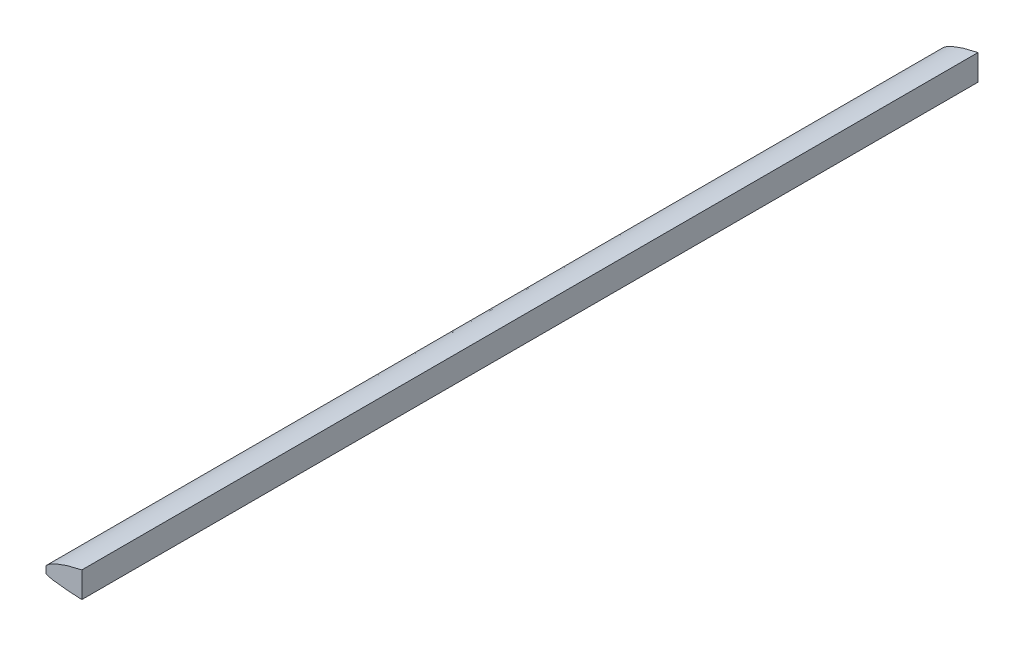
ISO-10303-21;
HEADER;
FILE_DESCRIPTION(('STEP AP214'),'2;1');
FILE_NAME('part.step','',(''),(''),'','','');
FILE_SCHEMA(('AUTOMOTIVE_DESIGN { 1 0 10303 214 1 1 1 1 }'));
ENDSEC;
DATA;
#1=APPLICATION_CONTEXT('core data for automotive mechanical design processes');
#2=APPLICATION_PROTOCOL_DEFINITION('international standard','automotive_design',2000,#1);
#3=PRODUCT_CONTEXT('',#1,'mechanical');
#4=PRODUCT('Part','Part','',(#3));
#5=PRODUCT_RELATED_PRODUCT_CATEGORY('part','',(#4));
#6=PRODUCT_DEFINITION_FORMATION('','',#4);
#7=PRODUCT_DEFINITION_CONTEXT('part definition',#1,'design');
#8=PRODUCT_DEFINITION('design','',#6,#7);
#9=PRODUCT_DEFINITION_SHAPE('','',#8);
#10=(LENGTH_UNIT() NAMED_UNIT(*) SI_UNIT(.MILLI.,.METRE.));
#11=(NAMED_UNIT(*) PLANE_ANGLE_UNIT() SI_UNIT($,.RADIAN.));
#12=(NAMED_UNIT(*) SI_UNIT($,.STERADIAN.) SOLID_ANGLE_UNIT());
#13=UNCERTAINTY_MEASURE_WITH_UNIT(LENGTH_MEASURE(1.E-05),#10,'distance_accuracy_value','');
#14=(GEOMETRIC_REPRESENTATION_CONTEXT(3) GLOBAL_UNCERTAINTY_ASSIGNED_CONTEXT((#13)) GLOBAL_UNIT_ASSIGNED_CONTEXT((#10,
#11,#12)) REPRESENTATION_CONTEXT('',''));
#15=CARTESIAN_POINT('',(0.,0.,0.));
#16=DIRECTION('',(0.,0.,1.));
#17=DIRECTION('',(1.,0.,0.));
#18=AXIS2_PLACEMENT_3D('',#15,#16,#17);
#19=CARTESIAN_POINT('',(0.,0.,146.05));
#20=DIRECTION('',(0.,0.,-1.));
#21=DIRECTION('',(-1.,0.,0.));
#22=AXIS2_PLACEMENT_3D('',#19,#20,#21);
#23=PLANE('',#22);
#24=DIRECTION('',(0.866025403784439,0.5,0.));
#25=VECTOR('',#24,1.);
#26=CARTESIAN_POINT('',(2.3303693429844,5.47680789310905,146.05));
#27=LINE('',#26,#25);
#28=CARTESIAN_POINT('',(2.3303693429844,5.47680789310905,146.05));
#29=VERTEX_POINT('',#28);
#30=CARTESIAN_POINT('',(5.07999999999999,7.06430789310905,146.05));
#31=VERTEX_POINT('',#30);
#32=EDGE_CURVE('E62',#29,#31,#27,.T.);
#33=ORIENTED_EDGE('',*,*,#32,.F.);
#34=DIRECTION('',(-0.866025403784439,0.5,0.));
#35=VECTOR('',#34,1.);
#36=CARTESIAN_POINT('',(5.08,3.88930789310905,146.05));
#37=LINE('',#36,#35);
#38=CARTESIAN_POINT('',(5.08,3.88930789310905,146.05));
#39=VERTEX_POINT('',#38);
#40=EDGE_CURVE('E124',#39,#29,#37,.T.);
#41=ORIENTED_EDGE('',*,*,#40,.F.);
#42=DIRECTION('',(0.,-1.,0.));
#43=VECTOR('',#42,1.);
#44=CARTESIAN_POINT('',(5.07999999999999,7.06430789310905,146.05));
#45=LINE('',#44,#43);
#46=EDGE_CURVE('E128',#31,#39,#45,.T.);
#47=ORIENTED_EDGE('',*,*,#46,.F.);
#48=EDGE_LOOP('',(#33,#41,#47));
#49=FACE_BOUND('',#48,.T.);
#50=CARTESIAN_POINT('',(153.012432907803,4.29837249355147,146.05));
#51=CARTESIAN_POINT('',(153.022573334159,4.30118431269829,146.05));
#52=CARTESIAN_POINT('',(152.678508981355,4.39868366144014,146.05));
#53=CARTESIAN_POINT('',(152.295031799488,4.45819845736958,146.05));
#54=CARTESIAN_POINT('',(151.419651144968,4.63623546443887,146.05));
#55=CARTESIAN_POINT('',(150.306621227649,4.81994518645088,146.05));
#56=CARTESIAN_POINT('',(148.842264128699,5.05275069448044,146.05));
#57=CARTESIAN_POINT('',(147.079406650399,5.30519000583204,146.05));
#58=CARTESIAN_POINT('',(145.005570500231,5.57759143301607,146.05));
#59=CARTESIAN_POINT('',(142.640765029642,5.86996469793655,146.05));
#60=CARTESIAN_POINT('',(139.989682455775,6.17922853478585,146.05));
#61=CARTESIAN_POINT('',(137.070106626542,6.51243791860869,146.05));
#62=CARTESIAN_POINT('',(133.884240493452,6.85688845391339,146.05));
#63=CARTESIAN_POINT('',(130.460581802081,7.23137195215701,146.05));
#64=CARTESIAN_POINT('',(126.794849786887,7.60644249223347,146.05));
#65=CARTESIAN_POINT('',(122.924160628096,8.00850621957419,146.05));
#66=CARTESIAN_POINT('',(118.840208590138,8.40089331029352,146.05));
#67=CARTESIAN_POINT('',(114.590309308745,8.82458088035817,146.05));
#68=CARTESIAN_POINT('',(110.158128176204,9.22165070858286,146.05));
#69=CARTESIAN_POINT('',(105.602476123186,9.64686823191567,146.05));
#70=CARTESIAN_POINT('',(100.897750103666,10.0165723520943,146.05));
#71=CARTESIAN_POINT('',(96.1098862738167,10.4049193208244,146.05));
#72=CARTESIAN_POINT('',(91.2149860561175,10.7205257289516,146.05));
#73=CARTESIAN_POINT('',(86.2751511916193,11.0442067251602,146.05));
#74=CARTESIAN_POINT('',(81.2734260591433,11.2779199326131,146.05));
#75=CARTESIAN_POINT('',(76.267137495775,11.5209089314635,146.05));
#76=CARTESIAN_POINT('',(71.2469211080151,11.6654306063464,146.05));
#77=CARTESIAN_POINT('',(66.258398862737,11.8205461864606,146.05));
#78=CARTESIAN_POINT('',(61.3048316502527,11.8630014345476,146.05));
#79=CARTESIAN_POINT('',(56.419109221408,11.9259648616699,146.05));
#80=CARTESIAN_POINT('',(51.6194124542509,11.8696352348893,146.05));
#81=CARTESIAN_POINT('',(46.9181564412518,11.8388145387859,146.05));
#82=CARTESIAN_POINT('',(42.355323514573,11.675352411223,146.05));
#83=CARTESIAN_POINT('',(37.9157653846814,11.5452903510272,146.05));
#84=CARTESIAN_POINT('',(33.6718477935265,11.2744230673563,146.05));
#85=CARTESIAN_POINT('',(29.5689843969307,11.0558893000296,146.05));
#86=CARTESIAN_POINT('',(25.7178012372257,10.6982868697439,146.05));
#87=CARTESIAN_POINT('',(22.0176822934619,10.4045123397973,146.05));
#88=CARTESIAN_POINT('',(18.6277024859319,9.97033824630898,146.05));
#89=CARTESIAN_POINT('',(15.3900972351653,9.61265907303944,146.05));
#90=CARTESIAN_POINT('',(12.5258162960307,9.11771225423672,146.05));
#91=CARTESIAN_POINT('',(9.79767436313593,8.71535866885037,146.05));
#92=CARTESIAN_POINT('',(7.50495718541674,8.1832668916392,146.05));
#93=CARTESIAN_POINT('',(5.39222181023161,7.73374483486204,146.05));
#94=CARTESIAN_POINT('',(3.57070788587368,7.26907779018686,146.05));
#95=CARTESIAN_POINT('',(2.12655851510634,6.74077448073247,146.05));
#96=CARTESIAN_POINT('',(0.914157710362412,6.19460042832124,146.05));
#97=CARTESIAN_POINT('',(0.15767537080493,5.6063909258422,146.05));
#98=CARTESIAN_POINT('',(-0.35698682188203,5.05550558679625,146.05));
#99=CARTESIAN_POINT('',(-0.678341927550519,4.61422846933056,146.05));
#100=CARTESIAN_POINT('',(-0.319052451785432,4.30324516681086,146.05));
#101=CARTESIAN_POINT('',(0.234859356501809,4.11539486330063,146.05));
#102=CARTESIAN_POINT('',(0.954407327379445,3.83068254754896,146.05));
#103=CARTESIAN_POINT('',(2.21877066694904,3.71764725258398,146.05));
#104=CARTESIAN_POINT('',(3.62457814535737,3.50273487916637,146.05));
#105=CARTESIAN_POINT('',(5.43785481775306,3.45031916594526,146.05));
#106=CARTESIAN_POINT('',(7.48693529718263,3.29497199585972,146.05));
#107=CARTESIAN_POINT('',(9.86816687280448,3.26475787543062,146.05));
#108=CARTESIAN_POINT('',(12.5081941404158,3.1509548472924,146.05));
#109=CARTESIAN_POINT('',(15.4362318824158,3.14185418539038,146.05));
#110=CARTESIAN_POINT('',(18.6151281650926,3.06467205968896,146.05));
#111=CARTESIAN_POINT('',(22.0463271189,3.08163266799285,146.05));
#112=CARTESIAN_POINT('',(25.7076515695333,3.04511260097475,146.05));
#113=CARTESIAN_POINT('',(29.5839092345066,3.09764845206463,146.05));
#114=CARTESIAN_POINT('',(33.6635362797634,3.10884545570665,146.05));
#115=CARTESIAN_POINT('',(37.920949513916,3.19981311775283,146.05));
#116=CARTESIAN_POINT('',(42.3490659476905,3.26290559648343,146.05));
#117=CARTESIAN_POINT('',(46.9146521732959,3.39923176622328,146.05));
#118=CARTESIAN_POINT('',(51.6136830932782,3.52012224006816,146.05));
#119=CARTESIAN_POINT('',(56.4099068791947,3.70493235913291,146.05));
#120=CARTESIAN_POINT('',(61.2981098510059,3.88761250696498,146.05));
#121=CARTESIAN_POINT('',(66.2450330473595,4.10924302409385,146.05));
#122=CARTESIAN_POINT('',(71.2391283330745,4.33403593791469,146.05));
#123=CARTESIAN_POINT('',(76.2494162289338,4.58425167157895,146.05));
#124=CARTESIAN_POINT('',(81.2624186759353,4.82798436590932,146.05));
#125=CARTESIAN_POINT('',(86.2526690324931,5.06862202845023,146.05));
#126=CARTESIAN_POINT('',(91.2039120683193,5.2809167159101,146.05));
#127=CARTESIAN_POINT('',(96.0865267873852,5.4887710665121,146.05));
#128=CARTESIAN_POINT('',(100.888840607821,5.65212866211545,146.05));
#129=CARTESIAN_POINT('',(105.581626282774,5.80420430333908,146.05));
#130=CARTESIAN_POINT('',(110.15254220831,5.90750661208399,146.05));
#131=CARTESIAN_POINT('',(114.576522504296,5.99101793059228,146.05));
#132=CARTESIAN_POINT('',(118.837497009477,6.03098892842079,146.05));
#133=CARTESIAN_POINT('',(122.915455049581,6.04285957328049,146.05));
#134=CARTESIAN_POINT('',(126.793680698212,6.01421549350386,146.05));
#135=CARTESIAN_POINT('',(130.455970759297,5.95060191346392,146.05));
#136=CARTESIAN_POINT('',(133.885862747905,5.85271808704428,146.05));
#137=CARTESIAN_POINT('',(137.069006345872,5.73047195884317,146.05));
#138=CARTESIAN_POINT('',(139.990790992459,5.58429748650498,146.05));
#139=CARTESIAN_POINT('',(142.640947983578,5.42420701731081,146.05));
#140=CARTESIAN_POINT('',(145.006736539072,5.25114523637785,146.05));
#141=CARTESIAN_POINT('',(147.078556667493,5.06763854279981,146.05));
#142=CARTESIAN_POINT('',(148.843562392255,4.88617709647787,146.05));
#143=CARTESIAN_POINT('',(150.306318308517,4.7029505630139,146.05));
#144=CARTESIAN_POINT('',(151.416283885139,4.55087689583804,146.05));
#145=CARTESIAN_POINT('',(152.292722615316,4.41207523136557,146.05));
#146=CARTESIAN_POINT('',(152.669747914108,4.35480990770027,146.05));
#147=CARTESIAN_POINT('',(153.003840170839,4.29598983019275,146.05));
#148=CARTESIAN_POINT('',(153.012432907803,4.29837249355147,146.05));
#149=B_SPLINE_CURVE_WITH_KNOTS('',3,(#50,#51,#52,#53,#54,#55,#56,#57,#58,#59,#60,#61,#62,#63,
#64,#65,#66,#67,#68,#69,#70,#71,#72,#73,#74,#75,#76,#77,#78,#79,#80,#81,#82,#83,#84,#85,#86,#87,
#88,#89,#90,#91,#92,#93,#94,#95,#96,#97,#98,#99,#100,#101,#102,#103,#104,#105,#106,#107,#108,
#109,#110,#111,#112,#113,#114,#115,#116,#117,#118,#119,#120,#121,#122,#123,#124,#125,#126,#127,
#128,#129,#130,#131,#132,#133,#134,#135,#136,#137,#138,#139,#140,#141,#142,#143,#144,#145,#146,
#147,#148),.UNSPECIFIED.,.T.,.F.,(4,1,1,1,1,1,1,1,1,1,1,1,1,1,1,1,1,1,1,1,1,1,1,1,1,1,1,1,1,1,1,
1,1,1,1,1,1,1,1,1,1,1,1,1,1,1,1,1,1,1,1,1,1,1,1,1,1,1,1,1,1,1,1,1,1,1,1,1,1,1,1,1,1,1,1,1,1,1,1,
1,1,1,1,1,1,1,1,1,1,1,1,1,1,1,1,1,4),(0.,0.000652375800474001,0.00240344824305293,
0.00525656825777616,0.00916576414525399,0.0140967507887129,0.0200220121070894,
0.0268963436763612,0.0347063828713069,0.0434144575923079,0.0529900197240517,0.0633968094728075,
0.0746012542197577,0.0865310302989372,0.099154299734113,0.112392946202992,0.126224491561968,
0.140544888717164,0.155318673337255,0.170431652347923,0.185859272314617,0.201486855100767,
0.21729337680491,0.233167489320596,0.249086100090761,0.264958726174628,0.280747986632832,
0.296380919150158,0.311801213814499,0.326956198280747,0.34178274714053,0.356247564285208,
0.370274835051458,0.383861908178782,0.396887692238994,0.409401211668324,0.421252505987224,
0.432540778472774,0.44306525269204,0.452987148289923,0.462044499089512,0.470525623352609,
0.478015713742355,0.484719935647003,0.490901449374763,0.496493482376747,0.501934630302492,
0.506331603851298,0.510717666514293,0.511954044649899,0.514195842006017,0.517506907461632,
0.521314719070869,0.526107089755545,0.531740962786565,0.538337761174815,0.545822104103918,
0.554208083816506,0.563431264261174,0.573484426850772,0.584310043394845,0.595866543172384,
0.608108296907278,0.620979221659939,0.634441733895477,0.648424207084819,0.662880137047378,
0.677739163464503,0.692957281121996,0.708452452705004,0.724176515371476,0.740041983978664,
0.755990469053507,0.771938352799948,0.787811293886201,0.803535896442132,0.819040498411977,
0.834255057735326,0.849121194519524,0.863570137224621,0.877552378440428,0.891006015922545,
0.903874254768139,0.916114355519662,0.927680383940068,0.938530909249465,0.948621564264013,
0.957908586509766,0.96636362872513,0.97395265018994,0.980639894713798,0.986402982837544,
0.991206560358905,0.995011197109476,0.997773025834374,0.999447193494769,1.),.UNSPECIFIED.);
#150=CARTESIAN_POINT('',(0.,5.42630262358505,146.05));
#151=VERTEX_POINT('',#150);
#152=CARTESIAN_POINT('',(6.35,7.93630563927071,146.05));
#153=VERTEX_POINT('',#152);
#154=EDGE_CURVE('E192',#151,#153,#149,.F.);
#155=ORIENTED_EDGE('',*,*,#154,.T.);
#156=DIRECTION('',(0.,-1.,0.));
#157=VECTOR('',#156,1.);
#158=CARTESIAN_POINT('',(6.35,0.,146.05));
#159=LINE('',#158,#157);
#160=CARTESIAN_POINT('',(6.35,3.38130789310905,146.05));
#161=VERTEX_POINT('',#160);
#162=EDGE_CURVE('E183',#153,#161,#159,.T.);
#163=ORIENTED_EDGE('',*,*,#162,.T.);
#164=CARTESIAN_POINT('',(153.012432907803,4.29837249355147,146.05));
#165=CARTESIAN_POINT('',(153.022573334159,4.30118431269829,146.05));
#166=CARTESIAN_POINT('',(152.678508981355,4.39868366144014,146.05));
#167=CARTESIAN_POINT('',(152.295031799488,4.45819845736958,146.05));
#168=CARTESIAN_POINT('',(151.419651144968,4.63623546443887,146.05));
#169=CARTESIAN_POINT('',(150.306621227649,4.81994518645088,146.05));
#170=CARTESIAN_POINT('',(148.842264128699,5.05275069448044,146.05));
#171=CARTESIAN_POINT('',(147.079406650399,5.30519000583204,146.05));
#172=CARTESIAN_POINT('',(145.005570500231,5.57759143301607,146.05));
#173=CARTESIAN_POINT('',(142.640765029642,5.86996469793655,146.05));
#174=CARTESIAN_POINT('',(139.989682455775,6.17922853478585,146.05));
#175=CARTESIAN_POINT('',(137.070106626542,6.51243791860869,146.05));
#176=CARTESIAN_POINT('',(133.884240493452,6.85688845391339,146.05));
#177=CARTESIAN_POINT('',(130.460581802081,7.23137195215701,146.05));
#178=CARTESIAN_POINT('',(126.794849786887,7.60644249223347,146.05));
#179=CARTESIAN_POINT('',(122.924160628096,8.00850621957419,146.05));
#180=CARTESIAN_POINT('',(118.840208590138,8.40089331029352,146.05));
#181=CARTESIAN_POINT('',(114.590309308745,8.82458088035817,146.05));
#182=CARTESIAN_POINT('',(110.158128176204,9.22165070858286,146.05));
#183=CARTESIAN_POINT('',(105.602476123186,9.64686823191567,146.05));
#184=CARTESIAN_POINT('',(100.897750103666,10.0165723520943,146.05));
#185=CARTESIAN_POINT('',(96.1098862738167,10.4049193208244,146.05));
#186=CARTESIAN_POINT('',(91.2149860561175,10.7205257289516,146.05));
#187=CARTESIAN_POINT('',(86.2751511916193,11.0442067251602,146.05));
#188=CARTESIAN_POINT('',(81.2734260591433,11.2779199326131,146.05));
#189=CARTESIAN_POINT('',(76.267137495775,11.5209089314635,146.05));
#190=CARTESIAN_POINT('',(71.2469211080151,11.6654306063464,146.05));
#191=CARTESIAN_POINT('',(66.258398862737,11.8205461864606,146.05));
#192=CARTESIAN_POINT('',(61.3048316502527,11.8630014345476,146.05));
#193=CARTESIAN_POINT('',(56.419109221408,11.9259648616699,146.05));
#194=CARTESIAN_POINT('',(51.6194124542509,11.8696352348893,146.05));
#195=CARTESIAN_POINT('',(46.9181564412518,11.8388145387859,146.05));
#196=CARTESIAN_POINT('',(42.355323514573,11.675352411223,146.05));
#197=CARTESIAN_POINT('',(37.9157653846814,11.5452903510272,146.05));
#198=CARTESIAN_POINT('',(33.6718477935265,11.2744230673563,146.05));
#199=CARTESIAN_POINT('',(29.5689843969307,11.0558893000296,146.05));
#200=CARTESIAN_POINT('',(25.7178012372257,10.6982868697439,146.05));
#201=CARTESIAN_POINT('',(22.0176822934619,10.4045123397973,146.05));
#202=CARTESIAN_POINT('',(18.6277024859319,9.97033824630898,146.05));
#203=CARTESIAN_POINT('',(15.3900972351653,9.61265907303944,146.05));
#204=CARTESIAN_POINT('',(12.5258162960307,9.11771225423672,146.05));
#205=CARTESIAN_POINT('',(9.79767436313593,8.71535866885037,146.05));
#206=CARTESIAN_POINT('',(7.50495718541674,8.1832668916392,146.05));
#207=CARTESIAN_POINT('',(5.39222181023161,7.73374483486204,146.05));
#208=CARTESIAN_POINT('',(3.57070788587368,7.26907779018686,146.05));
#209=CARTESIAN_POINT('',(2.12655851510634,6.74077448073247,146.05));
#210=CARTESIAN_POINT('',(0.914157710362412,6.19460042832124,146.05));
#211=CARTESIAN_POINT('',(0.15767537080493,5.6063909258422,146.05));
#212=CARTESIAN_POINT('',(-0.35698682188203,5.05550558679625,146.05));
#213=CARTESIAN_POINT('',(-0.678341927550519,4.61422846933056,146.05));
#214=CARTESIAN_POINT('',(-0.319052451785432,4.30324516681086,146.05));
#215=CARTESIAN_POINT('',(0.234859356501809,4.11539486330063,146.05));
#216=CARTESIAN_POINT('',(0.954407327379445,3.83068254754896,146.05));
#217=CARTESIAN_POINT('',(2.21877066694904,3.71764725258398,146.05));
#218=CARTESIAN_POINT('',(3.62457814535737,3.50273487916637,146.05));
#219=CARTESIAN_POINT('',(5.43785481775306,3.45031916594526,146.05));
#220=CARTESIAN_POINT('',(7.48693529718263,3.29497199585972,146.05));
#221=CARTESIAN_POINT('',(9.86816687280448,3.26475787543062,146.05));
#222=CARTESIAN_POINT('',(12.5081941404158,3.1509548472924,146.05));
#223=CARTESIAN_POINT('',(15.4362318824158,3.14185418539038,146.05));
#224=CARTESIAN_POINT('',(18.6151281650926,3.06467205968896,146.05));
#225=CARTESIAN_POINT('',(22.0463271189,3.08163266799285,146.05));
#226=CARTESIAN_POINT('',(25.7076515695333,3.04511260097475,146.05));
#227=CARTESIAN_POINT('',(29.5839092345066,3.09764845206463,146.05));
#228=CARTESIAN_POINT('',(33.6635362797634,3.10884545570665,146.05));
#229=CARTESIAN_POINT('',(37.920949513916,3.19981311775283,146.05));
#230=CARTESIAN_POINT('',(42.3490659476905,3.26290559648343,146.05));
#231=CARTESIAN_POINT('',(46.9146521732959,3.39923176622328,146.05));
#232=CARTESIAN_POINT('',(51.6136830932782,3.52012224006816,146.05));
#233=CARTESIAN_POINT('',(56.4099068791947,3.70493235913291,146.05));
#234=CARTESIAN_POINT('',(61.2981098510059,3.88761250696498,146.05));
#235=CARTESIAN_POINT('',(66.2450330473595,4.10924302409385,146.05));
#236=CARTESIAN_POINT('',(71.2391283330745,4.33403593791469,146.05));
#237=CARTESIAN_POINT('',(76.2494162289338,4.58425167157895,146.05));
#238=CARTESIAN_POINT('',(81.2624186759353,4.82798436590932,146.05));
#239=CARTESIAN_POINT('',(86.2526690324931,5.06862202845023,146.05));
#240=CARTESIAN_POINT('',(91.2039120683193,5.2809167159101,146.05));
#241=CARTESIAN_POINT('',(96.0865267873852,5.4887710665121,146.05));
#242=CARTESIAN_POINT('',(100.888840607821,5.65212866211545,146.05));
#243=CARTESIAN_POINT('',(105.581626282774,5.80420430333908,146.05));
#244=CARTESIAN_POINT('',(110.15254220831,5.90750661208399,146.05));
#245=CARTESIAN_POINT('',(114.576522504296,5.99101793059228,146.05));
#246=CARTESIAN_POINT('',(118.837497009477,6.03098892842079,146.05));
#247=CARTESIAN_POINT('',(122.915455049581,6.04285957328049,146.05));
#248=CARTESIAN_POINT('',(126.793680698212,6.01421549350386,146.05));
#249=CARTESIAN_POINT('',(130.455970759297,5.95060191346392,146.05));
#250=CARTESIAN_POINT('',(133.885862747905,5.85271808704428,146.05));
#251=CARTESIAN_POINT('',(137.069006345872,5.73047195884317,146.05));
#252=CARTESIAN_POINT('',(139.990790992459,5.58429748650498,146.05));
#253=CARTESIAN_POINT('',(142.640947983578,5.42420701731081,146.05));
#254=CARTESIAN_POINT('',(145.006736539072,5.25114523637785,146.05));
#255=CARTESIAN_POINT('',(147.078556667493,5.06763854279981,146.05));
#256=CARTESIAN_POINT('',(148.843562392255,4.88617709647787,146.05));
#257=CARTESIAN_POINT('',(150.306318308517,4.7029505630139,146.05));
#258=CARTESIAN_POINT('',(151.416283885139,4.55087689583804,146.05));
#259=CARTESIAN_POINT('',(152.292722615316,4.41207523136557,146.05));
#260=CARTESIAN_POINT('',(152.669747914108,4.35480990770027,146.05));
#261=CARTESIAN_POINT('',(153.003840170839,4.29598983019275,146.05));
#262=CARTESIAN_POINT('',(153.012432907803,4.29837249355147,146.05));
#263=B_SPLINE_CURVE_WITH_KNOTS('',3,(#164,#165,#166,#167,#168,#169,#170,#171,#172,#173,#174,
#175,#176,#177,#178,#179,#180,#181,#182,#183,#184,#185,#186,#187,#188,#189,#190,#191,#192,#193,
#194,#195,#196,#197,#198,#199,#200,#201,#202,#203,#204,#205,#206,#207,#208,#209,#210,#211,#212,
#213,#214,#215,#216,#217,#218,#219,#220,#221,#222,#223,#224,#225,#226,#227,#228,#229,#230,#231,
#232,#233,#234,#235,#236,#237,#238,#239,#240,#241,#242,#243,#244,#245,#246,#247,#248,#249,#250,
#251,#252,#253,#254,#255,#256,#257,#258,#259,#260,#261,#262),.UNSPECIFIED.,.T.,.F.,(4,1,1,1,1,1,
1,1,1,1,1,1,1,1,1,1,1,1,1,1,1,1,1,1,1,1,1,1,1,1,1,1,1,1,1,1,1,1,1,1,1,1,1,1,1,1,1,1,1,1,1,1,1,1,
1,1,1,1,1,1,1,1,1,1,1,1,1,1,1,1,1,1,1,1,1,1,1,1,1,1,1,1,1,1,1,1,1,1,1,1,1,1,1,1,1,1,4),(0.,
0.000652375800474001,0.00240344824305293,0.00525656825777616,0.00916576414525399,
0.0140967507887129,0.0200220121070894,0.0268963436763612,0.0347063828713069,0.0434144575923079,
0.0529900197240517,0.0633968094728075,0.0746012542197577,0.0865310302989372,0.099154299734113,
0.112392946202992,0.126224491561968,0.140544888717164,0.155318673337255,0.170431652347923,
0.185859272314617,0.201486855100767,0.21729337680491,0.233167489320596,0.249086100090761,
0.264958726174628,0.280747986632832,0.296380919150158,0.311801213814499,0.326956198280747,
0.34178274714053,0.356247564285208,0.370274835051458,0.383861908178782,0.396887692238994,
0.409401211668324,0.421252505987224,0.432540778472774,0.44306525269204,0.452987148289923,
0.462044499089512,0.470525623352609,0.478015713742355,0.484719935647003,0.490901449374763,
0.496493482376747,0.501934630302492,0.506331603851298,0.510717666514293,0.511954044649899,
0.514195842006017,0.517506907461632,0.521314719070869,0.526107089755545,0.531740962786565,
0.538337761174815,0.545822104103918,0.554208083816506,0.563431264261174,0.573484426850772,
0.584310043394845,0.595866543172384,0.608108296907278,0.620979221659939,0.634441733895477,
0.648424207084819,0.662880137047378,0.677739163464503,0.692957281121996,0.708452452705004,
0.724176515371476,0.740041983978664,0.755990469053507,0.771938352799948,0.787811293886201,
0.803535896442132,0.819040498411977,0.834255057735326,0.849121194519524,0.863570137224621,
0.877552378440428,0.891006015922545,0.903874254768139,0.916114355519662,0.927680383940068,
0.938530909249465,0.948621564264013,0.957908586509766,0.96636362872513,0.97395265018994,
0.980639894713798,0.986402982837544,0.991206560358905,0.995011197109476,0.997773025834374,
0.999447193494769,1.),.UNSPECIFIED.);
#264=CARTESIAN_POINT('',(0.,4.19416671617205,146.05));
#265=VERTEX_POINT('',#264);
#266=EDGE_CURVE('E140',#161,#265,#263,.F.);
#267=ORIENTED_EDGE('',*,*,#266,.T.);
#268=DIRECTION('',(0.,-1.,0.));
#269=VECTOR('',#268,1.);
#270=CARTESIAN_POINT('',(0.,0.,146.05));
#271=LINE('',#270,#269);
#272=EDGE_CURVE('E153',#151,#265,#271,.T.);
#273=ORIENTED_EDGE('',*,*,#272,.F.);
#274=EDGE_LOOP('',(#155,#163,#267,#273));
#275=FACE_BOUND('',#274,.T.);
#276=ADVANCED_FACE('F44',(#49,#275),#23,.T.);
#277=CARTESIAN_POINT('',(6.35,0.,304.8));
#278=DIRECTION('',(-1.,0.,0.));
#279=DIRECTION('',(0.,0.,1.));
#280=AXIS2_PLACEMENT_3D('',#277,#278,#279);
#281=PLANE('',#280);
#282=ORIENTED_EDGE('',*,*,#162,.F.);
#283=DIRECTION('',(0.,0.,-1.));
#284=VECTOR('',#283,1.);
#285=CARTESIAN_POINT('',(6.35,7.93630563927071,304.8));
#286=LINE('',#285,#284);
#287=CARTESIAN_POINT('',(6.35,7.93630563927071,304.8));
#288=VERTEX_POINT('',#287);
#289=EDGE_CURVE('E186',#288,#153,#286,.T.);
#290=ORIENTED_EDGE('',*,*,#289,.F.);
#291=DIRECTION('',(0.,1.,0.));
#292=VECTOR('',#291,1.);
#293=CARTESIAN_POINT('',(6.35,0.,304.8));
#294=LINE('',#293,#292);
#295=CARTESIAN_POINT('',(6.35,3.38130789310905,304.8));
#296=VERTEX_POINT('',#295);
#297=EDGE_CURVE('E11',#296,#288,#294,.T.);
#298=ORIENTED_EDGE('',*,*,#297,.F.);
#299=DIRECTION('',(0.,0.,-1.));
#300=VECTOR('',#299,1.);
#301=CARTESIAN_POINT('',(6.35,3.38130789310905,304.8));
#302=LINE('',#301,#300);
#303=EDGE_CURVE('E48',#296,#161,#302,.T.);
#304=ORIENTED_EDGE('',*,*,#303,.T.);
#305=EDGE_LOOP('',(#282,#290,#298,#304));
#306=FACE_BOUND('',#305,.T.);
#307=ADVANCED_FACE('F46',(#306),#281,.F.);
#308=CARTESIAN_POINT('',(153.012432907803,4.29837249355147,304.8));
#309=CARTESIAN_POINT('',(153.022573334159,4.30118431269829,304.8));
#310=CARTESIAN_POINT('',(152.678508981355,4.39868366144014,304.8));
#311=CARTESIAN_POINT('',(152.295031799488,4.45819845736958,304.8));
#312=CARTESIAN_POINT('',(151.419651144968,4.63623546443887,304.8));
#313=CARTESIAN_POINT('',(150.306621227649,4.81994518645088,304.8));
#314=CARTESIAN_POINT('',(148.842264128699,5.05275069448044,304.8));
#315=CARTESIAN_POINT('',(147.079406650399,5.30519000583204,304.8));
#316=CARTESIAN_POINT('',(145.005570500231,5.57759143301607,304.8));
#317=CARTESIAN_POINT('',(142.640765029642,5.86996469793655,304.8));
#318=CARTESIAN_POINT('',(139.989682455775,6.17922853478585,304.8));
#319=CARTESIAN_POINT('',(137.070106626542,6.51243791860869,304.8));
#320=CARTESIAN_POINT('',(133.884240493452,6.85688845391339,304.8));
#321=CARTESIAN_POINT('',(130.460581802081,7.23137195215701,304.8));
#322=CARTESIAN_POINT('',(126.794849786887,7.60644249223347,304.8));
#323=CARTESIAN_POINT('',(122.924160628096,8.00850621957419,304.8));
#324=CARTESIAN_POINT('',(118.840208590138,8.40089331029352,304.8));
#325=CARTESIAN_POINT('',(114.590309308745,8.82458088035817,304.8));
#326=CARTESIAN_POINT('',(110.158128176204,9.22165070858286,304.8));
#327=CARTESIAN_POINT('',(105.602476123186,9.64686823191567,304.8));
#328=CARTESIAN_POINT('',(100.897750103666,10.0165723520943,304.8));
#329=CARTESIAN_POINT('',(96.1098862738167,10.4049193208244,304.8));
#330=CARTESIAN_POINT('',(91.2149860561175,10.7205257289516,304.8));
#331=CARTESIAN_POINT('',(86.2751511916193,11.0442067251602,304.8));
#332=CARTESIAN_POINT('',(81.2734260591433,11.2779199326131,304.8));
#333=CARTESIAN_POINT('',(76.267137495775,11.5209089314635,304.8));
#334=CARTESIAN_POINT('',(71.2469211080151,11.6654306063464,304.8));
#335=CARTESIAN_POINT('',(66.258398862737,11.8205461864606,304.8));
#336=CARTESIAN_POINT('',(61.3048316502527,11.8630014345476,304.8));
#337=CARTESIAN_POINT('',(56.419109221408,11.9259648616699,304.8));
#338=CARTESIAN_POINT('',(51.6194124542509,11.8696352348893,304.8));
#339=CARTESIAN_POINT('',(46.9181564412518,11.8388145387859,304.8));
#340=CARTESIAN_POINT('',(42.355323514573,11.675352411223,304.8));
#341=CARTESIAN_POINT('',(37.9157653846814,11.5452903510272,304.8));
#342=CARTESIAN_POINT('',(33.6718477935265,11.2744230673563,304.8));
#343=CARTESIAN_POINT('',(29.5689843969307,11.0558893000296,304.8));
#344=CARTESIAN_POINT('',(25.7178012372257,10.6982868697439,304.8));
#345=CARTESIAN_POINT('',(22.0176822934619,10.4045123397973,304.8));
#346=CARTESIAN_POINT('',(18.6277024859319,9.97033824630898,304.8));
#347=CARTESIAN_POINT('',(15.3900972351653,9.61265907303944,304.8));
#348=CARTESIAN_POINT('',(12.5258162960307,9.11771225423672,304.8));
#349=CARTESIAN_POINT('',(9.79767436313593,8.71535866885037,304.8));
#350=CARTESIAN_POINT('',(7.50495718541674,8.1832668916392,304.8));
#351=CARTESIAN_POINT('',(5.39222181023161,7.73374483486204,304.8));
#352=CARTESIAN_POINT('',(3.57070788587368,7.26907779018686,304.8));
#353=CARTESIAN_POINT('',(2.12655851510634,6.74077448073247,304.8));
#354=CARTESIAN_POINT('',(0.914157710362412,6.19460042832124,304.8));
#355=CARTESIAN_POINT('',(0.15767537080493,5.6063909258422,304.8));
#356=CARTESIAN_POINT('',(-0.35698682188203,5.05550558679625,304.8));
#357=CARTESIAN_POINT('',(-0.678341927550519,4.61422846933056,304.8));
#358=CARTESIAN_POINT('',(-0.319052451785432,4.30324516681086,304.8));
#359=CARTESIAN_POINT('',(0.234859356501809,4.11539486330063,304.8));
#360=CARTESIAN_POINT('',(0.954407327379445,3.83068254754896,304.8));
#361=CARTESIAN_POINT('',(2.21877066694904,3.71764725258398,304.8));
#362=CARTESIAN_POINT('',(3.62457814535737,3.50273487916637,304.8));
#363=CARTESIAN_POINT('',(5.43785481775306,3.45031916594526,304.8));
#364=CARTESIAN_POINT('',(7.48693529718263,3.29497199585972,304.8));
#365=CARTESIAN_POINT('',(9.86816687280448,3.26475787543062,304.8));
#366=CARTESIAN_POINT('',(12.5081941404158,3.1509548472924,304.8));
#367=CARTESIAN_POINT('',(15.4362318824158,3.14185418539038,304.8));
#368=CARTESIAN_POINT('',(18.6151281650926,3.06467205968896,304.8));
#369=CARTESIAN_POINT('',(22.0463271189,3.08163266799285,304.8));
#370=CARTESIAN_POINT('',(25.7076515695333,3.04511260097475,304.8));
#371=CARTESIAN_POINT('',(29.5839092345066,3.09764845206463,304.8));
#372=CARTESIAN_POINT('',(33.6635362797634,3.10884545570665,304.8));
#373=CARTESIAN_POINT('',(37.920949513916,3.19981311775283,304.8));
#374=CARTESIAN_POINT('',(42.3490659476905,3.26290559648343,304.8));
#375=CARTESIAN_POINT('',(46.9146521732959,3.39923176622328,304.8));
#376=CARTESIAN_POINT('',(51.6136830932782,3.52012224006816,304.8));
#377=CARTESIAN_POINT('',(56.4099068791947,3.70493235913291,304.8));
#378=CARTESIAN_POINT('',(61.2981098510059,3.88761250696498,304.8));
#379=CARTESIAN_POINT('',(66.2450330473595,4.10924302409385,304.8));
#380=CARTESIAN_POINT('',(71.2391283330745,4.33403593791469,304.8));
#381=CARTESIAN_POINT('',(76.2494162289338,4.58425167157895,304.8));
#382=CARTESIAN_POINT('',(81.2624186759353,4.82798436590932,304.8));
#383=CARTESIAN_POINT('',(86.2526690324931,5.06862202845023,304.8));
#384=CARTESIAN_POINT('',(91.2039120683193,5.2809167159101,304.8));
#385=CARTESIAN_POINT('',(96.0865267873852,5.4887710665121,304.8));
#386=CARTESIAN_POINT('',(100.888840607821,5.65212866211545,304.8));
#387=CARTESIAN_POINT('',(105.581626282774,5.80420430333908,304.8));
#388=CARTESIAN_POINT('',(110.15254220831,5.90750661208399,304.8));
#389=CARTESIAN_POINT('',(114.576522504296,5.99101793059228,304.8));
#390=CARTESIAN_POINT('',(118.837497009477,6.03098892842079,304.8));
#391=CARTESIAN_POINT('',(122.915455049581,6.04285957328049,304.8));
#392=CARTESIAN_POINT('',(126.793680698212,6.01421549350386,304.8));
#393=CARTESIAN_POINT('',(130.455970759297,5.95060191346392,304.8));
#394=CARTESIAN_POINT('',(133.885862747905,5.85271808704428,304.8));
#395=CARTESIAN_POINT('',(137.069006345872,5.73047195884317,304.8));
#396=CARTESIAN_POINT('',(139.990790992459,5.58429748650498,304.8));
#397=CARTESIAN_POINT('',(142.640947983578,5.42420701731081,304.8));
#398=CARTESIAN_POINT('',(145.006736539072,5.25114523637785,304.8));
#399=CARTESIAN_POINT('',(147.078556667493,5.06763854279981,304.8));
#400=CARTESIAN_POINT('',(148.843562392255,4.88617709647787,304.8));
#401=CARTESIAN_POINT('',(150.306318308517,4.7029505630139,304.8));
#402=CARTESIAN_POINT('',(151.416283885139,4.55087689583804,304.8));
#403=CARTESIAN_POINT('',(152.292722615316,4.41207523136557,304.8));
#404=CARTESIAN_POINT('',(152.669747914108,4.35480990770027,304.8));
#405=CARTESIAN_POINT('',(153.003840170839,4.29598983019275,304.8));
#406=CARTESIAN_POINT('',(153.012432907803,4.29837249355147,304.8));
#407=B_SPLINE_CURVE_WITH_KNOTS('',3,(#308,#309,#310,#311,#312,#313,#314,#315,#316,#317,#318,
#319,#320,#321,#322,#323,#324,#325,#326,#327,#328,#329,#330,#331,#332,#333,#334,#335,#336,#337,
#338,#339,#340,#341,#342,#343,#344,#345,#346,#347,#348,#349,#350,#351,#352,#353,#354,#355,#356,
#357,#358,#359,#360,#361,#362,#363,#364,#365,#366,#367,#368,#369,#370,#371,#372,#373,#374,#375,
#376,#377,#378,#379,#380,#381,#382,#383,#384,#385,#386,#387,#388,#389,#390,#391,#392,#393,#394,
#395,#396,#397,#398,#399,#400,#401,#402,#403,#404,#405,#406),.UNSPECIFIED.,.T.,.F.,(4,1,1,1,1,1,
1,1,1,1,1,1,1,1,1,1,1,1,1,1,1,1,1,1,1,1,1,1,1,1,1,1,1,1,1,1,1,1,1,1,1,1,1,1,1,1,1,1,1,1,1,1,1,1,
1,1,1,1,1,1,1,1,1,1,1,1,1,1,1,1,1,1,1,1,1,1,1,1,1,1,1,1,1,1,1,1,1,1,1,1,1,1,1,1,1,1,4),(0.,
0.000652375800474001,0.00240344824305293,0.00525656825777616,0.00916576414525399,
0.0140967507887129,0.0200220121070894,0.0268963436763612,0.0347063828713069,0.0434144575923079,
0.0529900197240517,0.0633968094728075,0.0746012542197577,0.0865310302989372,0.099154299734113,
0.112392946202992,0.126224491561968,0.140544888717164,0.155318673337255,0.170431652347923,
0.185859272314617,0.201486855100767,0.21729337680491,0.233167489320596,0.249086100090761,
0.264958726174628,0.280747986632832,0.296380919150158,0.311801213814499,0.326956198280747,
0.34178274714053,0.356247564285208,0.370274835051458,0.383861908178782,0.396887692238994,
0.409401211668324,0.421252505987224,0.432540778472774,0.44306525269204,0.452987148289923,
0.462044499089512,0.470525623352609,0.478015713742355,0.484719935647003,0.490901449374763,
0.496493482376747,0.501934630302492,0.506331603851298,0.510717666514293,0.511954044649899,
0.514195842006017,0.517506907461632,0.521314719070869,0.526107089755545,0.531740962786565,
0.538337761174815,0.545822104103918,0.554208083816506,0.563431264261174,0.573484426850772,
0.584310043394845,0.595866543172384,0.608108296907278,0.620979221659939,0.634441733895477,
0.648424207084819,0.662880137047378,0.677739163464503,0.692957281121996,0.708452452705004,
0.724176515371476,0.740041983978664,0.755990469053507,0.771938352799948,0.787811293886201,
0.803535896442132,0.819040498411977,0.834255057735326,0.849121194519524,0.863570137224621,
0.877552378440428,0.891006015922545,0.903874254768139,0.916114355519662,0.927680383940068,
0.938530909249465,0.948621564264013,0.957908586509766,0.96636362872513,0.97395265018994,
0.980639894713798,0.986402982837544,0.991206560358905,0.995011197109476,0.997773025834374,
0.999447193494769,1.),.UNSPECIFIED.);
#408=DIRECTION('',(0.,0.,-1.));
#409=VECTOR('',#408,1.);
#410=SURFACE_OF_LINEAR_EXTRUSION('',#407,#409);
#411=ORIENTED_EDGE('',*,*,#154,.F.);
#412=DIRECTION('',(0.,0.,-1.));
#413=VECTOR('',#412,1.);
#414=CARTESIAN_POINT('',(0.,5.42630262358505,304.8));
#415=LINE('',#414,#413);
#416=CARTESIAN_POINT('',(0.,5.42630262358505,304.8));
#417=VERTEX_POINT('',#416);
#418=EDGE_CURVE('E212',#417,#151,#415,.T.);
#419=ORIENTED_EDGE('',*,*,#418,.F.);
#420=EDGE_CURVE('E54',#288,#417,#407,.T.);
#421=ORIENTED_EDGE('',*,*,#420,.F.);
#422=ORIENTED_EDGE('',*,*,#289,.T.);
#423=EDGE_LOOP('',(#411,#419,#421,#422));
#424=FACE_BOUND('',#423,.T.);
#425=ADVANCED_FACE('F159',(#424),#410,.F.);
#426=CARTESIAN_POINT('',(0.,0.,304.8));
#427=DIRECTION('',(-1.,0.,0.));
#428=DIRECTION('',(0.,-1.,0.));
#429=AXIS2_PLACEMENT_3D('',#426,#427,#428);
#430=PLANE('',#429);
#431=ORIENTED_EDGE('',*,*,#418,.T.);
#432=ORIENTED_EDGE('',*,*,#272,.T.);
#433=DIRECTION('',(0.,0.,-1.));
#434=VECTOR('',#433,1.);
#435=CARTESIAN_POINT('',(0.,4.19416671617205,304.8));
#436=LINE('',#435,#434);
#437=CARTESIAN_POINT('',(0.,4.19416671617205,304.8));
#438=VERTEX_POINT('',#437);
#439=EDGE_CURVE('E214',#438,#265,#436,.T.);
#440=ORIENTED_EDGE('',*,*,#439,.F.);
#441=DIRECTION('',(0.,1.,0.));
#442=VECTOR('',#441,1.);
#443=CARTESIAN_POINT('',(0.,0.,304.8));
#444=LINE('',#443,#442);
#445=EDGE_CURVE('E143',#438,#417,#444,.T.);
#446=ORIENTED_EDGE('',*,*,#445,.T.);
#447=EDGE_LOOP('',(#431,#432,#440,#446));
#448=FACE_BOUND('',#447,.T.);
#449=ADVANCED_FACE('F162',(#448),#430,.T.);
#450=ORIENTED_EDGE('',*,*,#266,.F.);
#451=ORIENTED_EDGE('',*,*,#303,.F.);
#452=EDGE_CURVE('E146',#438,#296,#407,.T.);
#453=ORIENTED_EDGE('',*,*,#452,.F.);
#454=ORIENTED_EDGE('',*,*,#439,.T.);
#455=EDGE_LOOP('',(#450,#451,#453,#454));
#456=FACE_BOUND('',#455,.T.);
#457=ADVANCED_FACE('F163',(#456),#410,.F.);
#458=CARTESIAN_POINT('',(0.,0.,304.8));
#459=DIRECTION('',(0.,0.,1.));
#460=DIRECTION('',(1.,0.,0.));
#461=AXIS2_PLACEMENT_3D('',#458,#459,#460);
#462=PLANE('',#461);
#463=ORIENTED_EDGE('',*,*,#297,.T.);
#464=ORIENTED_EDGE('',*,*,#420,.T.);
#465=ORIENTED_EDGE('',*,*,#445,.F.);
#466=ORIENTED_EDGE('',*,*,#452,.T.);
#467=EDGE_LOOP('',(#463,#464,#465,#466));
#468=FACE_BOUND('',#467,.T.);
#469=ADVANCED_FACE('F170',(#468),#462,.T.);
#470=CARTESIAN_POINT('',(2.3303693429844,5.47680789310905,161.29));
#471=DIRECTION('',(-0.5,0.866025403784439,0.));
#472=DIRECTION('',(-0.866025403784439,-0.5,0.));
#473=AXIS2_PLACEMENT_3D('',#470,#471,#472);
#474=PLANE('',#473);
#475=ORIENTED_EDGE('',*,*,#32,.T.);
#476=DIRECTION('',(0.,0.,-1.));
#477=VECTOR('',#476,1.);
#478=CARTESIAN_POINT('',(5.07999999999999,7.06430789310905,161.29));
#479=LINE('',#478,#477);
#480=CARTESIAN_POINT('',(5.07999999999999,7.06430789310905,161.29));
#481=VERTEX_POINT('',#480);
#482=EDGE_CURVE('E102',#481,#31,#479,.T.);
#483=ORIENTED_EDGE('',*,*,#482,.F.);
#484=DIRECTION('',(0.866025403784439,0.5,0.));
#485=VECTOR('',#484,1.);
#486=CARTESIAN_POINT('',(2.3303693429844,5.47680789310905,161.29));
#487=LINE('',#486,#485);
#488=CARTESIAN_POINT('',(2.3303693429844,5.47680789310905,161.29));
#489=VERTEX_POINT('',#488);
#490=EDGE_CURVE('E106',#489,#481,#487,.T.);
#491=ORIENTED_EDGE('',*,*,#490,.F.);
#492=DIRECTION('',(0.,0.,-1.));
#493=VECTOR('',#492,1.);
#494=CARTESIAN_POINT('',(2.3303693429844,5.47680789310905,161.29));
#495=LINE('',#494,#493);
#496=EDGE_CURVE('E137',#489,#29,#495,.T.);
#497=ORIENTED_EDGE('',*,*,#496,.T.);
#498=EDGE_LOOP('',(#475,#483,#491,#497));
#499=FACE_BOUND('',#498,.T.);
#500=ADVANCED_FACE('F104',(#499),#474,.F.);
#501=CARTESIAN_POINT('',(5.08,3.88930789310905,161.29));
#502=DIRECTION('',(-0.5,-0.866025403784439,0.));
#503=DIRECTION('',(0.866025403784439,-0.5,0.));
#504=AXIS2_PLACEMENT_3D('',#501,#502,#503);
#505=PLANE('',#504);
#506=ORIENTED_EDGE('',*,*,#40,.T.);
#507=ORIENTED_EDGE('',*,*,#496,.F.);
#508=DIRECTION('',(-0.866025403784439,0.5,0.));
#509=VECTOR('',#508,1.);
#510=CARTESIAN_POINT('',(5.08,3.88930789310905,161.29));
#511=LINE('',#510,#509);
#512=CARTESIAN_POINT('',(5.08,3.88930789310905,161.29));
#513=VERTEX_POINT('',#512);
#514=EDGE_CURVE('E113',#513,#489,#511,.T.);
#515=ORIENTED_EDGE('',*,*,#514,.F.);
#516=DIRECTION('',(0.,0.,-1.));
#517=VECTOR('',#516,1.);
#518=CARTESIAN_POINT('',(5.08,3.88930789310905,161.29));
#519=LINE('',#518,#517);
#520=EDGE_CURVE('E112',#513,#39,#519,.T.);
#521=ORIENTED_EDGE('',*,*,#520,.T.);
#522=EDGE_LOOP('',(#506,#507,#515,#521));
#523=FACE_BOUND('',#522,.T.);
#524=ADVANCED_FACE('F226',(#523),#505,.F.);
#525=CARTESIAN_POINT('',(5.07999999999999,7.06430789310905,161.29));
#526=DIRECTION('',(1.,0.,0.));
#527=DIRECTION('',(0.,1.,0.));
#528=AXIS2_PLACEMENT_3D('',#525,#526,#527);
#529=PLANE('',#528);
#530=ORIENTED_EDGE('',*,*,#46,.T.);
#531=ORIENTED_EDGE('',*,*,#520,.F.);
#532=DIRECTION('',(0.,-1.,0.));
#533=VECTOR('',#532,1.);
#534=CARTESIAN_POINT('',(5.07999999999999,7.06430789310905,161.29));
#535=LINE('',#534,#533);
#536=EDGE_CURVE('E116',#481,#513,#535,.T.);
#537=ORIENTED_EDGE('',*,*,#536,.F.);
#538=ORIENTED_EDGE('',*,*,#482,.T.);
#539=EDGE_LOOP('',(#530,#531,#537,#538));
#540=FACE_BOUND('',#539,.T.);
#541=ADVANCED_FACE('F117',(#540),#529,.F.);
#542=CARTESIAN_POINT('',(0.,0.,161.29));
#543=DIRECTION('',(0.,0.,-1.));
#544=DIRECTION('',(-1.,0.,0.));
#545=AXIS2_PLACEMENT_3D('',#542,#543,#544);
#546=PLANE('',#545);
#547=ORIENTED_EDGE('',*,*,#490,.T.);
#548=ORIENTED_EDGE('',*,*,#536,.T.);
#549=ORIENTED_EDGE('',*,*,#514,.T.);
#550=EDGE_LOOP('',(#547,#548,#549));
#551=FACE_BOUND('',#550,.T.);
#552=ADVANCED_FACE('F122',(#551),#546,.T.);
#553=CLOSED_SHELL('',(#276,#307,#425,#449,#457,#469,#500,#524,#541,#552));
#554=MANIFOLD_SOLID_BREP('B2',#553);
#555=ADVANCED_BREP_SHAPE_REPRESENTATION('',(#18,#554),#14);
#556=SHAPE_DEFINITION_REPRESENTATION(#9,#555);
ENDSEC;
END-ISO-10303-21;
